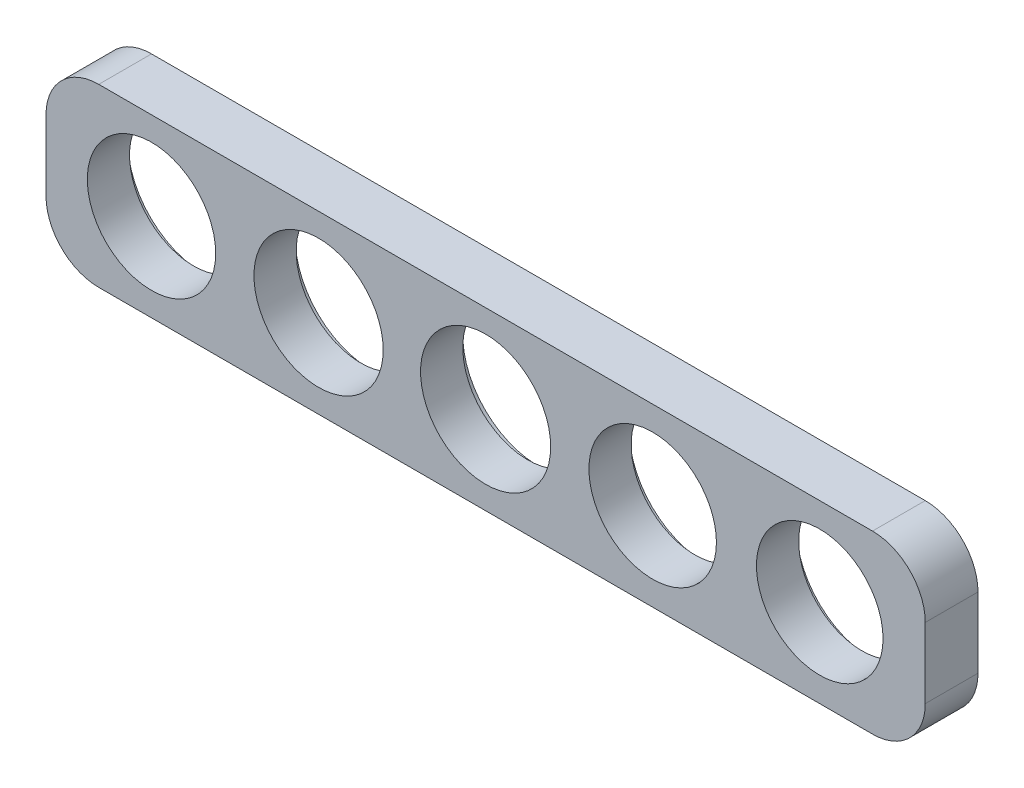
ISO-10303-21;
HEADER;
FILE_DESCRIPTION(('STEP AP214'),'2;1');
FILE_NAME('part.step','',(''),(''),'','','');
FILE_SCHEMA(('AUTOMOTIVE_DESIGN { 1 0 10303 214 1 1 1 1 }'));
ENDSEC;
DATA;
#1=APPLICATION_CONTEXT('core data for automotive mechanical design processes');
#2=APPLICATION_PROTOCOL_DEFINITION('international standard','automotive_design',2000,#1);
#3=PRODUCT_CONTEXT('',#1,'mechanical');
#4=PRODUCT('Part','Part','',(#3));
#5=PRODUCT_RELATED_PRODUCT_CATEGORY('part','',(#4));
#6=PRODUCT_DEFINITION_FORMATION('','',#4);
#7=PRODUCT_DEFINITION_CONTEXT('part definition',#1,'design');
#8=PRODUCT_DEFINITION('design','',#6,#7);
#9=PRODUCT_DEFINITION_SHAPE('','',#8);
#10=(LENGTH_UNIT() NAMED_UNIT(*) SI_UNIT(.MILLI.,.METRE.));
#11=(NAMED_UNIT(*) PLANE_ANGLE_UNIT() SI_UNIT($,.RADIAN.));
#12=(NAMED_UNIT(*) SI_UNIT($,.STERADIAN.) SOLID_ANGLE_UNIT());
#13=UNCERTAINTY_MEASURE_WITH_UNIT(LENGTH_MEASURE(1.E-05),#10,'distance_accuracy_value','');
#14=(GEOMETRIC_REPRESENTATION_CONTEXT(3) GLOBAL_UNCERTAINTY_ASSIGNED_CONTEXT((#13)) GLOBAL_UNIT_ASSIGNED_CONTEXT((#10,
#11,#12)) REPRESENTATION_CONTEXT('',''));
#15=CARTESIAN_POINT('',(0.,0.,0.));
#16=DIRECTION('',(0.,0.,1.));
#17=DIRECTION('',(1.,0.,0.));
#18=AXIS2_PLACEMENT_3D('',#15,#16,#17);
#19=CARTESIAN_POINT('',(-50.,10.,3.));
#20=DIRECTION('',(1.,0.,0.));
#21=DIRECTION('',(0.,0.,-1.));
#22=AXIS2_PLACEMENT_3D('',#19,#20,#21);
#23=PLANE('',#22);
#24=DIRECTION('',(0.,-1.,0.));
#25=VECTOR('',#24,1.);
#26=CARTESIAN_POINT('',(-50.,10.,3.));
#27=LINE('',#26,#25);
#28=CARTESIAN_POINT('',(-50.,7.,3.));
#29=VERTEX_POINT('',#28);
#30=CARTESIAN_POINT('',(-50.,3.,3.));
#31=VERTEX_POINT('',#30);
#32=EDGE_CURVE('E131',#29,#31,#27,.T.);
#33=ORIENTED_EDGE('',*,*,#32,.F.);
#34=DIRECTION('',(0.,0.,-1.));
#35=VECTOR('',#34,1.);
#36=CARTESIAN_POINT('',(-50.,7.,0.));
#37=LINE('',#36,#35);
#38=CARTESIAN_POINT('',(-50.,7.,0.));
#39=VERTEX_POINT('',#38);
#40=EDGE_CURVE('E115',#29,#39,#37,.T.);
#41=ORIENTED_EDGE('',*,*,#40,.T.);
#42=DIRECTION('',(0.,-1.,0.));
#43=VECTOR('',#42,1.);
#44=CARTESIAN_POINT('',(-50.,10.,0.));
#45=LINE('',#44,#43);
#46=CARTESIAN_POINT('',(-50.,3.,0.));
#47=VERTEX_POINT('',#46);
#48=EDGE_CURVE('E128',#39,#47,#45,.T.);
#49=ORIENTED_EDGE('',*,*,#48,.T.);
#50=DIRECTION('',(0.,0.,-1.));
#51=VECTOR('',#50,1.);
#52=CARTESIAN_POINT('',(-50.,3.,3.));
#53=LINE('',#52,#51);
#54=EDGE_CURVE('E134',#47,#31,#53,.F.);
#55=ORIENTED_EDGE('',*,*,#54,.T.);
#56=EDGE_LOOP('',(#33,#41,#49,#55));
#57=FACE_BOUND('',#56,.T.);
#58=ADVANCED_FACE('F45',(#57),#23,.F.);
#59=CARTESIAN_POINT('',(-50.,0.,3.));
#60=DIRECTION('',(0.,1.,0.));
#61=DIRECTION('',(-1.,0.,0.));
#62=AXIS2_PLACEMENT_3D('',#59,#60,#61);
#63=PLANE('',#62);
#64=DIRECTION('',(1.,0.,0.));
#65=VECTOR('',#64,1.);
#66=CARTESIAN_POINT('',(-50.,0.,3.));
#67=LINE('',#66,#65);
#68=CARTESIAN_POINT('',(-47.,0.,3.));
#69=VERTEX_POINT('',#68);
#70=CARTESIAN_POINT('',(-3.,0.,3.));
#71=VERTEX_POINT('',#70);
#72=EDGE_CURVE('E207',#69,#71,#67,.T.);
#73=ORIENTED_EDGE('',*,*,#72,.F.);
#74=DIRECTION('',(0.,0.,-1.));
#75=VECTOR('',#74,1.);
#76=CARTESIAN_POINT('',(-47.,0.,3.));
#77=LINE('',#76,#75);
#78=CARTESIAN_POINT('',(-47.,0.,0.));
#79=VERTEX_POINT('',#78);
#80=EDGE_CURVE('E188',#69,#79,#77,.T.);
#81=ORIENTED_EDGE('',*,*,#80,.T.);
#82=DIRECTION('',(1.,0.,0.));
#83=VECTOR('',#82,1.);
#84=CARTESIAN_POINT('',(-50.,0.,0.));
#85=LINE('',#84,#83);
#86=CARTESIAN_POINT('',(-3.,0.,0.));
#87=VERTEX_POINT('',#86);
#88=EDGE_CURVE('E139',#79,#87,#85,.T.);
#89=ORIENTED_EDGE('',*,*,#88,.T.);
#90=DIRECTION('',(0.,0.,-1.));
#91=VECTOR('',#90,1.);
#92=CARTESIAN_POINT('',(-3.,0.,3.));
#93=LINE('',#92,#91);
#94=EDGE_CURVE('E185',#87,#71,#93,.F.);
#95=ORIENTED_EDGE('',*,*,#94,.T.);
#96=EDGE_LOOP('',(#73,#81,#89,#95));
#97=FACE_BOUND('',#96,.T.);
#98=ADVANCED_FACE('F324',(#97),#63,.F.);
#99=CARTESIAN_POINT('',(0.,10.,3.));
#100=DIRECTION('',(1.,0.,0.));
#101=DIRECTION('',(0.,0.,-1.));
#102=AXIS2_PLACEMENT_3D('',#99,#100,#101);
#103=PLANE('',#102);
#104=DIRECTION('',(0.,-1.,0.));
#105=VECTOR('',#104,1.);
#106=CARTESIAN_POINT('',(0.,10.,0.));
#107=LINE('',#106,#105);
#108=CARTESIAN_POINT('',(0.,7.,0.));
#109=VERTEX_POINT('',#108);
#110=CARTESIAN_POINT('',(0.,3.,0.));
#111=VERTEX_POINT('',#110);
#112=EDGE_CURVE('E145',#109,#111,#107,.T.);
#113=ORIENTED_EDGE('',*,*,#112,.F.);
#114=DIRECTION('',(0.,0.,-1.));
#115=VECTOR('',#114,1.);
#116=CARTESIAN_POINT('',(0.,7.,3.));
#117=LINE('',#116,#115);
#118=CARTESIAN_POINT('',(0.,7.,3.));
#119=VERTEX_POINT('',#118);
#120=EDGE_CURVE('E11',#109,#119,#117,.F.);
#121=ORIENTED_EDGE('',*,*,#120,.T.);
#122=DIRECTION('',(0.,-1.,0.));
#123=VECTOR('',#122,1.);
#124=CARTESIAN_POINT('',(0.,10.,3.));
#125=LINE('',#124,#123);
#126=CARTESIAN_POINT('',(0.,3.,3.));
#127=VERTEX_POINT('',#126);
#128=EDGE_CURVE('E195',#119,#127,#125,.T.);
#129=ORIENTED_EDGE('',*,*,#128,.T.);
#130=DIRECTION('',(0.,0.,-1.));
#131=VECTOR('',#130,1.);
#132=CARTESIAN_POINT('',(0.,3.,0.));
#133=LINE('',#132,#131);
#134=EDGE_CURVE('E54',#127,#111,#133,.T.);
#135=ORIENTED_EDGE('',*,*,#134,.T.);
#136=EDGE_LOOP('',(#113,#121,#129,#135));
#137=FACE_BOUND('',#136,.T.);
#138=ADVANCED_FACE('F194',(#137),#103,.T.);
#139=CARTESIAN_POINT('',(-50.,10.,3.));
#140=DIRECTION('',(0.,1.,0.));
#141=DIRECTION('',(-1.,0.,0.));
#142=AXIS2_PLACEMENT_3D('',#139,#140,#141);
#143=PLANE('',#142);
#144=DIRECTION('',(1.,0.,0.));
#145=VECTOR('',#144,1.);
#146=CARTESIAN_POINT('',(-50.,10.,0.));
#147=LINE('',#146,#145);
#148=CARTESIAN_POINT('',(-47.,10.,0.));
#149=VERTEX_POINT('',#148);
#150=CARTESIAN_POINT('',(-3.,10.,0.));
#151=VERTEX_POINT('',#150);
#152=EDGE_CURVE('E157',#149,#151,#147,.T.);
#153=ORIENTED_EDGE('',*,*,#152,.F.);
#154=DIRECTION('',(0.,0.,-1.));
#155=VECTOR('',#154,1.);
#156=CARTESIAN_POINT('',(-47.,10.,3.));
#157=LINE('',#156,#155);
#158=CARTESIAN_POINT('',(-47.,10.,3.));
#159=VERTEX_POINT('',#158);
#160=EDGE_CURVE('E116',#149,#159,#157,.F.);
#161=ORIENTED_EDGE('',*,*,#160,.T.);
#162=DIRECTION('',(1.,0.,0.));
#163=VECTOR('',#162,1.);
#164=CARTESIAN_POINT('',(-50.,10.,3.));
#165=LINE('',#164,#163);
#166=CARTESIAN_POINT('',(-3.,10.,3.));
#167=VERTEX_POINT('',#166);
#168=EDGE_CURVE('E151',#159,#167,#165,.T.);
#169=ORIENTED_EDGE('',*,*,#168,.T.);
#170=DIRECTION('',(0.,0.,-1.));
#171=VECTOR('',#170,1.);
#172=CARTESIAN_POINT('',(-3.,10.,3.));
#173=LINE('',#172,#171);
#174=EDGE_CURVE('E122',#167,#151,#173,.T.);
#175=ORIENTED_EDGE('',*,*,#174,.T.);
#176=EDGE_LOOP('',(#153,#161,#169,#175));
#177=FACE_BOUND('',#176,.T.);
#178=ADVANCED_FACE('F203',(#177),#143,.T.);
#179=CARTESIAN_POINT('',(0.,0.,3.));
#180=DIRECTION('',(0.,0.,1.));
#181=DIRECTION('',(1.,0.,0.));
#182=AXIS2_PLACEMENT_3D('',#179,#180,#181);
#183=PLANE('',#182);
#184=CARTESIAN_POINT('',(-15.5,5.,3.));
#185=DIRECTION('',(0.,0.,1.));
#186=DIRECTION('',(1.,0.,0.));
#187=AXIS2_PLACEMENT_3D('',#184,#185,#186);
#188=CIRCLE('',#187,3.625);
#189=CARTESIAN_POINT('',(-11.875,5.,3.));
#190=VERTEX_POINT('',#189);
#191=EDGE_CURVE('E213',#190,#190,#188,.T.);
#192=ORIENTED_EDGE('',*,*,#191,.F.);
#193=EDGE_LOOP('',(#192));
#194=FACE_BOUND('',#193,.T.);
#195=CARTESIAN_POINT('',(-6.,5.,3.));
#196=DIRECTION('',(0.,0.,1.));
#197=DIRECTION('',(1.,0.,0.));
#198=AXIS2_PLACEMENT_3D('',#195,#196,#197);
#199=CIRCLE('',#198,3.6);
#200=CARTESIAN_POINT('',(-2.4,5.,3.));
#201=VERTEX_POINT('',#200);
#202=EDGE_CURVE('E217',#201,#201,#199,.T.);
#203=ORIENTED_EDGE('',*,*,#202,.F.);
#204=EDGE_LOOP('',(#203));
#205=FACE_BOUND('',#204,.T.);
#206=CARTESIAN_POINT('',(-44.,5.,3.));
#207=DIRECTION('',(0.,0.,1.));
#208=DIRECTION('',(1.,0.,0.));
#209=AXIS2_PLACEMENT_3D('',#206,#207,#208);
#210=CIRCLE('',#209,3.65);
#211=CARTESIAN_POINT('',(-40.35,5.,3.));
#212=VERTEX_POINT('',#211);
#213=EDGE_CURVE('E222',#212,#212,#210,.T.);
#214=ORIENTED_EDGE('',*,*,#213,.F.);
#215=EDGE_LOOP('',(#214));
#216=FACE_BOUND('',#215,.T.);
#217=CARTESIAN_POINT('',(-34.5,5.,3.));
#218=DIRECTION('',(0.,0.,1.));
#219=DIRECTION('',(1.,0.,0.));
#220=AXIS2_PLACEMENT_3D('',#217,#218,#219);
#221=CIRCLE('',#220,3.675);
#222=CARTESIAN_POINT('',(-30.825,5.,3.));
#223=VERTEX_POINT('',#222);
#224=EDGE_CURVE('E148',#223,#223,#221,.T.);
#225=ORIENTED_EDGE('',*,*,#224,.F.);
#226=EDGE_LOOP('',(#225));
#227=FACE_BOUND('',#226,.T.);
#228=CARTESIAN_POINT('',(-25.,5.,3.));
#229=DIRECTION('',(0.,0.,1.));
#230=DIRECTION('',(1.,0.,0.));
#231=AXIS2_PLACEMENT_3D('',#228,#229,#230);
#232=CIRCLE('',#231,3.7);
#233=CARTESIAN_POINT('',(-21.3,5.,3.));
#234=VERTEX_POINT('',#233);
#235=EDGE_CURVE('E140',#234,#234,#232,.T.);
#236=ORIENTED_EDGE('',*,*,#235,.F.);
#237=EDGE_LOOP('',(#236));
#238=FACE_BOUND('',#237,.T.);
#239=ORIENTED_EDGE('',*,*,#168,.F.);
#240=CARTESIAN_POINT('',(-47.,7.,3.));
#241=DIRECTION('',(0.,0.,1.));
#242=DIRECTION('',(1.,0.,0.));
#243=AXIS2_PLACEMENT_3D('',#240,#241,#242);
#244=CIRCLE('',#243,3.);
#245=EDGE_CURVE('E182',#159,#29,#244,.T.);
#246=ORIENTED_EDGE('',*,*,#245,.T.);
#247=ORIENTED_EDGE('',*,*,#32,.T.);
#248=CARTESIAN_POINT('',(-47.,3.,3.));
#249=DIRECTION('',(0.,0.,1.));
#250=DIRECTION('',(1.,0.,0.));
#251=AXIS2_PLACEMENT_3D('',#248,#249,#250);
#252=CIRCLE('',#251,3.);
#253=EDGE_CURVE('E179',#31,#69,#252,.T.);
#254=ORIENTED_EDGE('',*,*,#253,.T.);
#255=ORIENTED_EDGE('',*,*,#72,.T.);
#256=CARTESIAN_POINT('',(-3.,3.,3.));
#257=DIRECTION('',(0.,0.,1.));
#258=DIRECTION('',(1.,0.,0.));
#259=AXIS2_PLACEMENT_3D('',#256,#257,#258);
#260=CIRCLE('',#259,3.);
#261=EDGE_CURVE('E61',#71,#127,#260,.T.);
#262=ORIENTED_EDGE('',*,*,#261,.T.);
#263=ORIENTED_EDGE('',*,*,#128,.F.);
#264=CARTESIAN_POINT('',(-3.,7.,3.));
#265=DIRECTION('',(0.,0.,1.));
#266=DIRECTION('',(1.,0.,0.));
#267=AXIS2_PLACEMENT_3D('',#264,#265,#266);
#268=CIRCLE('',#267,3.);
#269=EDGE_CURVE('E176',#119,#167,#268,.T.);
#270=ORIENTED_EDGE('',*,*,#269,.T.);
#271=EDGE_LOOP('',(#239,#246,#247,#254,#255,#262,#263,#270));
#272=FACE_BOUND('',#271,.T.);
#273=ADVANCED_FACE('F300',(#194,#205,#216,#227,#238,#272),#183,.T.);
#274=CARTESIAN_POINT('',(0.,0.,0.));
#275=DIRECTION('',(0.,0.,1.));
#276=DIRECTION('',(1.,0.,0.));
#277=AXIS2_PLACEMENT_3D('',#274,#275,#276);
#278=PLANE('',#277);
#279=CARTESIAN_POINT('',(-6.,5.,0.));
#280=DIRECTION('',(0.,0.,1.));
#281=DIRECTION('',(1.,0.,0.));
#282=AXIS2_PLACEMENT_3D('',#279,#280,#281);
#283=CIRCLE('',#282,4.325);
#284=CARTESIAN_POINT('',(-1.675,5.,0.));
#285=VERTEX_POINT('',#284);
#286=EDGE_CURVE('E241',#285,#285,#283,.T.);
#287=ORIENTED_EDGE('',*,*,#286,.T.);
#288=EDGE_LOOP('',(#287));
#289=FACE_BOUND('',#288,.T.);
#290=CARTESIAN_POINT('',(-15.5,5.,0.));
#291=DIRECTION('',(0.,0.,1.));
#292=DIRECTION('',(1.,0.,0.));
#293=AXIS2_PLACEMENT_3D('',#290,#291,#292);
#294=CIRCLE('',#293,4.325);
#295=CARTESIAN_POINT('',(-11.175,5.,0.));
#296=VERTEX_POINT('',#295);
#297=EDGE_CURVE('E250',#296,#296,#294,.T.);
#298=ORIENTED_EDGE('',*,*,#297,.T.);
#299=EDGE_LOOP('',(#298));
#300=FACE_BOUND('',#299,.T.);
#301=CARTESIAN_POINT('',(-34.5,5.,0.));
#302=DIRECTION('',(0.,0.,1.));
#303=DIRECTION('',(1.,0.,0.));
#304=AXIS2_PLACEMENT_3D('',#301,#302,#303);
#305=CIRCLE('',#304,4.325);
#306=CARTESIAN_POINT('',(-30.175,5.,0.));
#307=VERTEX_POINT('',#306);
#308=EDGE_CURVE('E262',#307,#307,#305,.T.);
#309=ORIENTED_EDGE('',*,*,#308,.T.);
#310=EDGE_LOOP('',(#309));
#311=FACE_BOUND('',#310,.T.);
#312=CARTESIAN_POINT('',(-44.,5.,0.));
#313=DIRECTION('',(0.,0.,1.));
#314=DIRECTION('',(1.,0.,0.));
#315=AXIS2_PLACEMENT_3D('',#312,#313,#314);
#316=CIRCLE('',#315,4.35);
#317=CARTESIAN_POINT('',(-39.65,5.,0.));
#318=VERTEX_POINT('',#317);
#319=EDGE_CURVE('E274',#318,#318,#316,.T.);
#320=ORIENTED_EDGE('',*,*,#319,.T.);
#321=EDGE_LOOP('',(#320));
#322=FACE_BOUND('',#321,.T.);
#323=CARTESIAN_POINT('',(-25.,5.,0.));
#324=DIRECTION('',(0.,0.,1.));
#325=DIRECTION('',(1.,0.,0.));
#326=AXIS2_PLACEMENT_3D('',#323,#324,#325);
#327=CIRCLE('',#326,4.3);
#328=CARTESIAN_POINT('',(-20.7,5.,0.));
#329=VERTEX_POINT('',#328);
#330=EDGE_CURVE('E229',#329,#329,#327,.T.);
#331=ORIENTED_EDGE('',*,*,#330,.T.);
#332=EDGE_LOOP('',(#331));
#333=FACE_BOUND('',#332,.T.);
#334=ORIENTED_EDGE('',*,*,#48,.F.);
#335=CARTESIAN_POINT('',(-47.,7.,0.));
#336=DIRECTION('',(0.,0.,1.));
#337=DIRECTION('',(1.,0.,0.));
#338=AXIS2_PLACEMENT_3D('',#335,#336,#337);
#339=CIRCLE('',#338,3.);
#340=EDGE_CURVE('E111',#39,#149,#339,.F.);
#341=ORIENTED_EDGE('',*,*,#340,.T.);
#342=ORIENTED_EDGE('',*,*,#152,.T.);
#343=CARTESIAN_POINT('',(-3.,7.,0.));
#344=DIRECTION('',(0.,0.,1.));
#345=DIRECTION('',(1.,0.,0.));
#346=AXIS2_PLACEMENT_3D('',#343,#344,#345);
#347=CIRCLE('',#346,3.);
#348=EDGE_CURVE('E164',#151,#109,#347,.F.);
#349=ORIENTED_EDGE('',*,*,#348,.T.);
#350=ORIENTED_EDGE('',*,*,#112,.T.);
#351=CARTESIAN_POINT('',(-3.,3.,0.));
#352=DIRECTION('',(0.,0.,1.));
#353=DIRECTION('',(1.,0.,0.));
#354=AXIS2_PLACEMENT_3D('',#351,#352,#353);
#355=CIRCLE('',#354,3.);
#356=EDGE_CURVE('E133',#111,#87,#355,.F.);
#357=ORIENTED_EDGE('',*,*,#356,.T.);
#358=ORIENTED_EDGE('',*,*,#88,.F.);
#359=CARTESIAN_POINT('',(-47.,3.,0.));
#360=DIRECTION('',(0.,0.,1.));
#361=DIRECTION('',(1.,0.,0.));
#362=AXIS2_PLACEMENT_3D('',#359,#360,#361);
#363=CIRCLE('',#362,3.);
#364=EDGE_CURVE('E123',#79,#47,#363,.F.);
#365=ORIENTED_EDGE('',*,*,#364,.T.);
#366=EDGE_LOOP('',(#334,#341,#342,#349,#350,#357,#358,#365));
#367=FACE_BOUND('',#366,.T.);
#368=ADVANCED_FACE('F136',(#289,#300,#311,#322,#333,#367),#278,.F.);
#369=CARTESIAN_POINT('',(-25.,5.,3.));
#370=DIRECTION('',(0.,0.,-1.));
#371=DIRECTION('',(-1.,0.,0.));
#372=AXIS2_PLACEMENT_3D('',#369,#370,#371);
#373=CYLINDRICAL_SURFACE('',#372,3.7);
#374=CARTESIAN_POINT('',(-25.,5.,0.6));
#375=DIRECTION('',(0.,0.,1.));
#376=DIRECTION('',(1.,0.,0.));
#377=AXIS2_PLACEMENT_3D('',#374,#375,#376);
#378=CIRCLE('',#377,3.7);
#379=CARTESIAN_POINT('',(-21.3,5.,0.6));
#380=VERTEX_POINT('',#379);
#381=EDGE_CURVE('E233',#380,#380,#378,.T.);
#382=ORIENTED_EDGE('',*,*,#381,.F.);
#383=EDGE_LOOP('',(#382));
#384=FACE_BOUND('',#383,.T.);
#385=ORIENTED_EDGE('',*,*,#235,.T.);
#386=EDGE_LOOP('',(#385));
#387=FACE_BOUND('',#386,.T.);
#388=ADVANCED_FACE('F309',(#384,#387),#373,.F.);
#389=CARTESIAN_POINT('',(-34.5,5.,3.));
#390=DIRECTION('',(0.,0.,-1.));
#391=DIRECTION('',(-1.,0.,0.));
#392=AXIS2_PLACEMENT_3D('',#389,#390,#391);
#393=CYLINDRICAL_SURFACE('',#392,3.675);
#394=CARTESIAN_POINT('',(-34.5,5.,0.6));
#395=DIRECTION('',(0.,0.,1.));
#396=DIRECTION('',(1.,0.,0.));
#397=AXIS2_PLACEMENT_3D('',#394,#395,#396);
#398=CIRCLE('',#397,3.675);
#399=CARTESIAN_POINT('',(-30.825,5.,0.6));
#400=VERTEX_POINT('',#399);
#401=EDGE_CURVE('E269',#400,#400,#398,.T.);
#402=ORIENTED_EDGE('',*,*,#401,.F.);
#403=EDGE_LOOP('',(#402));
#404=FACE_BOUND('',#403,.T.);
#405=ORIENTED_EDGE('',*,*,#224,.T.);
#406=EDGE_LOOP('',(#405));
#407=FACE_BOUND('',#406,.T.);
#408=ADVANCED_FACE('F296',(#404,#407),#393,.F.);
#409=CARTESIAN_POINT('',(-44.,5.,3.));
#410=DIRECTION('',(0.,0.,-1.));
#411=DIRECTION('',(-1.,0.,0.));
#412=AXIS2_PLACEMENT_3D('',#409,#410,#411);
#413=CYLINDRICAL_SURFACE('',#412,3.65);
#414=CARTESIAN_POINT('',(-44.,5.,0.6));
#415=DIRECTION('',(0.,0.,1.));
#416=DIRECTION('',(1.,0.,0.));
#417=AXIS2_PLACEMENT_3D('',#414,#415,#416);
#418=CIRCLE('',#417,3.65);
#419=CARTESIAN_POINT('',(-40.35,5.,0.6));
#420=VERTEX_POINT('',#419);
#421=EDGE_CURVE('E281',#420,#420,#418,.T.);
#422=ORIENTED_EDGE('',*,*,#421,.F.);
#423=EDGE_LOOP('',(#422));
#424=FACE_BOUND('',#423,.T.);
#425=ORIENTED_EDGE('',*,*,#213,.T.);
#426=EDGE_LOOP('',(#425));
#427=FACE_BOUND('',#426,.T.);
#428=ADVANCED_FACE('F292',(#424,#427),#413,.F.);
#429=CARTESIAN_POINT('',(-6.,5.,3.));
#430=DIRECTION('',(0.,0.,-1.));
#431=DIRECTION('',(-1.,0.,0.));
#432=AXIS2_PLACEMENT_3D('',#429,#430,#431);
#433=CYLINDRICAL_SURFACE('',#432,3.6);
#434=CARTESIAN_POINT('',(-6.,5.,0.6));
#435=DIRECTION('',(0.,0.,1.));
#436=DIRECTION('',(1.,0.,0.));
#437=AXIS2_PLACEMENT_3D('',#434,#435,#436);
#438=CIRCLE('',#437,3.6);
#439=CARTESIAN_POINT('',(-2.4,5.,0.6));
#440=VERTEX_POINT('',#439);
#441=EDGE_CURVE('E245',#440,#440,#438,.T.);
#442=ORIENTED_EDGE('',*,*,#441,.F.);
#443=EDGE_LOOP('',(#442));
#444=FACE_BOUND('',#443,.T.);
#445=ORIENTED_EDGE('',*,*,#202,.T.);
#446=EDGE_LOOP('',(#445));
#447=FACE_BOUND('',#446,.T.);
#448=ADVANCED_FACE('F295',(#444,#447),#433,.F.);
#449=CARTESIAN_POINT('',(-15.5,5.,3.));
#450=DIRECTION('',(0.,0.,-1.));
#451=DIRECTION('',(-1.,0.,0.));
#452=AXIS2_PLACEMENT_3D('',#449,#450,#451);
#453=CYLINDRICAL_SURFACE('',#452,3.625);
#454=CARTESIAN_POINT('',(-15.5,5.,0.6));
#455=DIRECTION('',(0.,0.,1.));
#456=DIRECTION('',(1.,0.,0.));
#457=AXIS2_PLACEMENT_3D('',#454,#455,#456);
#458=CIRCLE('',#457,3.625);
#459=CARTESIAN_POINT('',(-11.875,5.,0.6));
#460=VERTEX_POINT('',#459);
#461=EDGE_CURVE('E257',#460,#460,#458,.T.);
#462=ORIENTED_EDGE('',*,*,#461,.F.);
#463=EDGE_LOOP('',(#462));
#464=FACE_BOUND('',#463,.T.);
#465=ORIENTED_EDGE('',*,*,#191,.T.);
#466=EDGE_LOOP('',(#465));
#467=FACE_BOUND('',#466,.T.);
#468=ADVANCED_FACE('F463',(#464,#467),#453,.F.);
#469=CARTESIAN_POINT('',(-15.5,5.,0.6));
#470=DIRECTION('',(0.,0.,-1.));
#471=DIRECTION('',(-1.,0.,0.));
#472=AXIS2_PLACEMENT_3D('',#469,#470,#471);
#473=CYLINDRICAL_SURFACE('',#472,4.325);
#474=CARTESIAN_POINT('',(-15.5,5.,0.6));
#475=DIRECTION('',(0.,0.,1.));
#476=DIRECTION('',(1.,0.,0.));
#477=AXIS2_PLACEMENT_3D('',#474,#475,#476);
#478=CIRCLE('',#477,4.325);
#479=CARTESIAN_POINT('',(-11.175,5.,0.6));
#480=VERTEX_POINT('',#479);
#481=EDGE_CURVE('E258',#480,#480,#478,.T.);
#482=ORIENTED_EDGE('',*,*,#481,.T.);
#483=EDGE_LOOP('',(#482));
#484=FACE_BOUND('',#483,.T.);
#485=ORIENTED_EDGE('',*,*,#297,.F.);
#486=EDGE_LOOP('',(#485));
#487=FACE_BOUND('',#486,.T.);
#488=ADVANCED_FACE('F453',(#484,#487),#473,.F.);
#489=CARTESIAN_POINT('',(0.,0.,0.6));
#490=DIRECTION('',(0.,0.,1.));
#491=DIRECTION('',(1.,0.,0.));
#492=AXIS2_PLACEMENT_3D('',#489,#490,#491);
#493=PLANE('',#492);
#494=ORIENTED_EDGE('',*,*,#461,.T.);
#495=EDGE_LOOP('',(#494));
#496=FACE_BOUND('',#495,.T.);
#497=ORIENTED_EDGE('',*,*,#481,.F.);
#498=EDGE_LOOP('',(#497));
#499=FACE_BOUND('',#498,.T.);
#500=ADVANCED_FACE('F443',(#496,#499),#493,.F.);
#501=CARTESIAN_POINT('',(-6.,5.,0.6));
#502=DIRECTION('',(0.,0.,-1.));
#503=DIRECTION('',(-1.,0.,0.));
#504=AXIS2_PLACEMENT_3D('',#501,#502,#503);
#505=CYLINDRICAL_SURFACE('',#504,4.325);
#506=CARTESIAN_POINT('',(-6.,5.,0.6));
#507=DIRECTION('',(0.,0.,1.));
#508=DIRECTION('',(1.,0.,0.));
#509=AXIS2_PLACEMENT_3D('',#506,#507,#508);
#510=CIRCLE('',#509,4.325);
#511=CARTESIAN_POINT('',(-1.675,5.,0.6));
#512=VERTEX_POINT('',#511);
#513=EDGE_CURVE('E246',#512,#512,#510,.T.);
#514=ORIENTED_EDGE('',*,*,#513,.T.);
#515=EDGE_LOOP('',(#514));
#516=FACE_BOUND('',#515,.T.);
#517=ORIENTED_EDGE('',*,*,#286,.F.);
#518=EDGE_LOOP('',(#517));
#519=FACE_BOUND('',#518,.T.);
#520=ADVANCED_FACE('F433',(#516,#519),#505,.F.);
#521=CARTESIAN_POINT('',(0.,0.,0.6));
#522=DIRECTION('',(0.,0.,1.));
#523=DIRECTION('',(1.,0.,0.));
#524=AXIS2_PLACEMENT_3D('',#521,#522,#523);
#525=PLANE('',#524);
#526=ORIENTED_EDGE('',*,*,#441,.T.);
#527=EDGE_LOOP('',(#526));
#528=FACE_BOUND('',#527,.T.);
#529=ORIENTED_EDGE('',*,*,#513,.F.);
#530=EDGE_LOOP('',(#529));
#531=FACE_BOUND('',#530,.T.);
#532=ADVANCED_FACE('F423',(#528,#531),#525,.F.);
#533=CARTESIAN_POINT('',(-44.,5.,0.6));
#534=DIRECTION('',(0.,0.,-1.));
#535=DIRECTION('',(-1.,0.,0.));
#536=AXIS2_PLACEMENT_3D('',#533,#534,#535);
#537=CYLINDRICAL_SURFACE('',#536,4.35);
#538=CARTESIAN_POINT('',(-44.,5.,0.6));
#539=DIRECTION('',(0.,0.,1.));
#540=DIRECTION('',(1.,0.,0.));
#541=AXIS2_PLACEMENT_3D('',#538,#539,#540);
#542=CIRCLE('',#541,4.35);
#543=CARTESIAN_POINT('',(-39.65,5.,0.6));
#544=VERTEX_POINT('',#543);
#545=EDGE_CURVE('E234',#544,#544,#542,.T.);
#546=ORIENTED_EDGE('',*,*,#545,.T.);
#547=EDGE_LOOP('',(#546));
#548=FACE_BOUND('',#547,.T.);
#549=ORIENTED_EDGE('',*,*,#319,.F.);
#550=EDGE_LOOP('',(#549));
#551=FACE_BOUND('',#550,.T.);
#552=ADVANCED_FACE('F414',(#548,#551),#537,.F.);
#553=CARTESIAN_POINT('',(0.,0.,0.6));
#554=DIRECTION('',(0.,0.,1.));
#555=DIRECTION('',(1.,0.,0.));
#556=AXIS2_PLACEMENT_3D('',#553,#554,#555);
#557=PLANE('',#556);
#558=ORIENTED_EDGE('',*,*,#421,.T.);
#559=EDGE_LOOP('',(#558));
#560=FACE_BOUND('',#559,.T.);
#561=ORIENTED_EDGE('',*,*,#545,.F.);
#562=EDGE_LOOP('',(#561));
#563=FACE_BOUND('',#562,.T.);
#564=ADVANCED_FACE('F289',(#560,#563),#557,.F.);
#565=CARTESIAN_POINT('',(-34.5,5.,0.6));
#566=DIRECTION('',(0.,0.,-1.));
#567=DIRECTION('',(-1.,0.,0.));
#568=AXIS2_PLACEMENT_3D('',#565,#566,#567);
#569=CYLINDRICAL_SURFACE('',#568,4.325);
#570=CARTESIAN_POINT('',(-34.5,5.,0.6));
#571=DIRECTION('',(0.,0.,1.));
#572=DIRECTION('',(1.,0.,0.));
#573=AXIS2_PLACEMENT_3D('',#570,#571,#572);
#574=CIRCLE('',#573,4.325);
#575=CARTESIAN_POINT('',(-30.175,5.,0.6));
#576=VERTEX_POINT('',#575);
#577=EDGE_CURVE('E270',#576,#576,#574,.T.);
#578=ORIENTED_EDGE('',*,*,#577,.T.);
#579=EDGE_LOOP('',(#578));
#580=FACE_BOUND('',#579,.T.);
#581=ORIENTED_EDGE('',*,*,#308,.F.);
#582=EDGE_LOOP('',(#581));
#583=FACE_BOUND('',#582,.T.);
#584=ADVANCED_FACE('F395',(#580,#583),#569,.F.);
#585=CARTESIAN_POINT('',(0.,0.,0.6));
#586=DIRECTION('',(0.,0.,1.));
#587=DIRECTION('',(1.,0.,0.));
#588=AXIS2_PLACEMENT_3D('',#585,#586,#587);
#589=PLANE('',#588);
#590=ORIENTED_EDGE('',*,*,#401,.T.);
#591=EDGE_LOOP('',(#590));
#592=FACE_BOUND('',#591,.T.);
#593=ORIENTED_EDGE('',*,*,#577,.F.);
#594=EDGE_LOOP('',(#593));
#595=FACE_BOUND('',#594,.T.);
#596=ADVANCED_FACE('F385',(#592,#595),#589,.F.);
#597=CARTESIAN_POINT('',(-25.,5.,0.6));
#598=DIRECTION('',(0.,0.,-1.));
#599=DIRECTION('',(-1.,0.,0.));
#600=AXIS2_PLACEMENT_3D('',#597,#598,#599);
#601=CYLINDRICAL_SURFACE('',#600,4.3);
#602=CARTESIAN_POINT('',(-25.,5.,0.6));
#603=DIRECTION('',(0.,0.,1.));
#604=DIRECTION('',(1.,0.,0.));
#605=AXIS2_PLACEMENT_3D('',#602,#603,#604);
#606=CIRCLE('',#605,4.3);
#607=CARTESIAN_POINT('',(-20.7,5.,0.6));
#608=VERTEX_POINT('',#607);
#609=EDGE_CURVE('E218',#608,#608,#606,.T.);
#610=ORIENTED_EDGE('',*,*,#609,.T.);
#611=EDGE_LOOP('',(#610));
#612=FACE_BOUND('',#611,.T.);
#613=ORIENTED_EDGE('',*,*,#330,.F.);
#614=EDGE_LOOP('',(#613));
#615=FACE_BOUND('',#614,.T.);
#616=ADVANCED_FACE('F375',(#612,#615),#601,.F.);
#617=CARTESIAN_POINT('',(0.,0.,0.6));
#618=DIRECTION('',(0.,0.,1.));
#619=DIRECTION('',(1.,0.,0.));
#620=AXIS2_PLACEMENT_3D('',#617,#618,#619);
#621=PLANE('',#620);
#622=ORIENTED_EDGE('',*,*,#381,.T.);
#623=EDGE_LOOP('',(#622));
#624=FACE_BOUND('',#623,.T.);
#625=ORIENTED_EDGE('',*,*,#609,.F.);
#626=EDGE_LOOP('',(#625));
#627=FACE_BOUND('',#626,.T.);
#628=ADVANCED_FACE('F337',(#624,#627),#621,.F.);
#629=CARTESIAN_POINT('',(-47.,7.,3.));
#630=DIRECTION('',(0.,0.,1.));
#631=DIRECTION('',(1.,0.,0.));
#632=AXIS2_PLACEMENT_3D('',#629,#630,#631);
#633=CYLINDRICAL_SURFACE('',#632,3.);
#634=ORIENTED_EDGE('',*,*,#245,.F.);
#635=ORIENTED_EDGE('',*,*,#160,.F.);
#636=ORIENTED_EDGE('',*,*,#340,.F.);
#637=ORIENTED_EDGE('',*,*,#40,.F.);
#638=EDGE_LOOP('',(#634,#635,#636,#637));
#639=FACE_BOUND('',#638,.T.);
#640=ADVANCED_FACE('F114',(#639),#633,.T.);
#641=CARTESIAN_POINT('',(-47.,3.,3.));
#642=DIRECTION('',(0.,0.,-1.));
#643=DIRECTION('',(-1.,0.,0.));
#644=AXIS2_PLACEMENT_3D('',#641,#642,#643);
#645=CYLINDRICAL_SURFACE('',#644,3.);
#646=ORIENTED_EDGE('',*,*,#253,.F.);
#647=ORIENTED_EDGE('',*,*,#54,.F.);
#648=ORIENTED_EDGE('',*,*,#364,.F.);
#649=ORIENTED_EDGE('',*,*,#80,.F.);
#650=EDGE_LOOP('',(#646,#647,#648,#649));
#651=FACE_BOUND('',#650,.T.);
#652=ADVANCED_FACE('F336',(#651),#645,.T.);
#653=CARTESIAN_POINT('',(-3.,7.,3.));
#654=DIRECTION('',(0.,0.,-1.));
#655=DIRECTION('',(-1.,0.,0.));
#656=AXIS2_PLACEMENT_3D('',#653,#654,#655);
#657=CYLINDRICAL_SURFACE('',#656,3.);
#658=ORIENTED_EDGE('',*,*,#269,.F.);
#659=ORIENTED_EDGE('',*,*,#120,.F.);
#660=ORIENTED_EDGE('',*,*,#348,.F.);
#661=ORIENTED_EDGE('',*,*,#174,.F.);
#662=EDGE_LOOP('',(#658,#659,#660,#661));
#663=FACE_BOUND('',#662,.T.);
#664=ADVANCED_FACE('F200',(#663),#657,.T.);
#665=CARTESIAN_POINT('',(-3.,3.,3.));
#666=DIRECTION('',(0.,0.,1.));
#667=DIRECTION('',(1.,0.,0.));
#668=AXIS2_PLACEMENT_3D('',#665,#666,#667);
#669=CYLINDRICAL_SURFACE('',#668,3.);
#670=ORIENTED_EDGE('',*,*,#261,.F.);
#671=ORIENTED_EDGE('',*,*,#94,.F.);
#672=ORIENTED_EDGE('',*,*,#356,.F.);
#673=ORIENTED_EDGE('',*,*,#134,.F.);
#674=EDGE_LOOP('',(#670,#671,#672,#673));
#675=FACE_BOUND('',#674,.T.);
#676=ADVANCED_FACE('F47',(#675),#669,.T.);
#677=CLOSED_SHELL('',(#58,#98,#138,#178,#273,#368,#388,#408,#428,#448,#468,#488,#500,#520,#532,
#552,#564,#584,#596,#616,#628,#640,#652,#664,#676));
#678=MANIFOLD_SOLID_BREP('B2',#677);
#679=ADVANCED_BREP_SHAPE_REPRESENTATION('',(#18,#678),#14);
#680=SHAPE_DEFINITION_REPRESENTATION(#9,#679);
ENDSEC;
END-ISO-10303-21;
